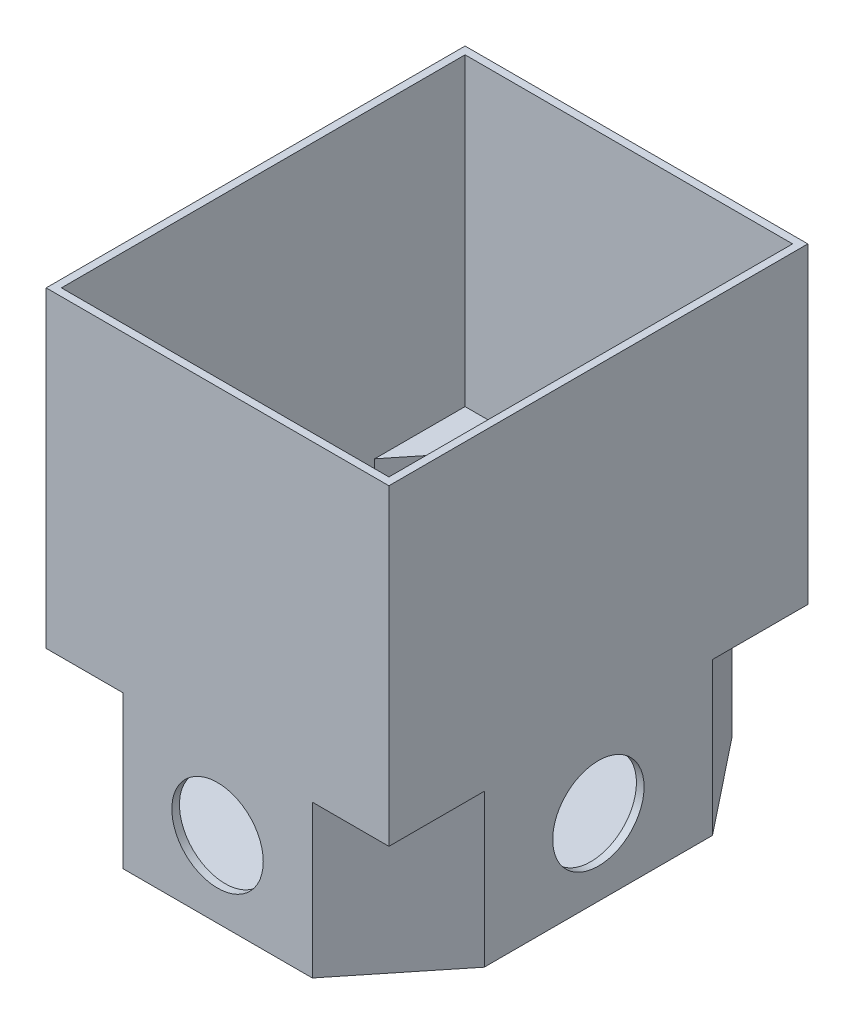
ISO-10303-21;
HEADER;
FILE_DESCRIPTION(('STEP AP214'),'2;1');
FILE_NAME('part.step','',(''),(''),'','','');
FILE_SCHEMA(('AUTOMOTIVE_DESIGN { 1 0 10303 214 1 1 1 1 }'));
ENDSEC;
DATA;
#1=APPLICATION_CONTEXT('core data for automotive mechanical design processes');
#2=APPLICATION_PROTOCOL_DEFINITION('international standard','automotive_design',2000,#1);
#3=PRODUCT_CONTEXT('',#1,'mechanical');
#4=PRODUCT('Part','Part','',(#3));
#5=PRODUCT_RELATED_PRODUCT_CATEGORY('part','',(#4));
#6=PRODUCT_DEFINITION_FORMATION('','',#4);
#7=PRODUCT_DEFINITION_CONTEXT('part definition',#1,'design');
#8=PRODUCT_DEFINITION('design','',#6,#7);
#9=PRODUCT_DEFINITION_SHAPE('','',#8);
#10=(LENGTH_UNIT() NAMED_UNIT(*) SI_UNIT(.MILLI.,.METRE.));
#11=(NAMED_UNIT(*) PLANE_ANGLE_UNIT() SI_UNIT($,.RADIAN.));
#12=(NAMED_UNIT(*) SI_UNIT($,.STERADIAN.) SOLID_ANGLE_UNIT());
#13=UNCERTAINTY_MEASURE_WITH_UNIT(LENGTH_MEASURE(1.E-05),#10,'distance_accuracy_value','');
#14=(GEOMETRIC_REPRESENTATION_CONTEXT(3) GLOBAL_UNCERTAINTY_ASSIGNED_CONTEXT((#13)) GLOBAL_UNIT_ASSIGNED_CONTEXT((#10,
#11,#12)) REPRESENTATION_CONTEXT('',''));
#15=CARTESIAN_POINT('',(0.,0.,0.));
#16=DIRECTION('',(0.,0.,1.));
#17=DIRECTION('',(1.,0.,0.));
#18=AXIS2_PLACEMENT_3D('',#15,#16,#17);
#19=CARTESIAN_POINT('',(0.,1.99999999999999,0.));
#20=DIRECTION('',(0.,-1.,0.));
#21=DIRECTION('',(0.,0.,-1.));
#22=AXIS2_PLACEMENT_3D('',#19,#20,#21);
#23=PLANE('',#22);
#24=DIRECTION('',(0.626402673453942,0.,-0.779499641237733));
#25=VECTOR('',#24,1.);
#26=CARTESIAN_POINT('',(9.36406161476732,1.99999999999999,49.6967114952726));
#27=LINE('',#26,#25);
#28=CARTESIAN_POINT('',(9.36406161476732,1.99999999999999,49.6967114952726));
#29=VERTEX_POINT('',#28);
#30=CARTESIAN_POINT('',(28.4415766183495,1.99999999999999,25.9565253000214));
#31=VERTEX_POINT('',#30);
#32=EDGE_CURVE('E290',#29,#31,#27,.T.);
#33=ORIENTED_EDGE('',*,*,#32,.F.);
#34=DIRECTION('',(1.,0.,0.));
#35=VECTOR('',#34,1.);
#36=CARTESIAN_POINT('',(-57.5584233816505,1.99999999999999,49.6967114952725));
#37=LINE('',#36,#35);
#38=CARTESIAN_POINT('',(28.4415766183495,1.99999999999999,49.6967114952729));
#39=VERTEX_POINT('',#38);
#40=EDGE_CURVE('E427',#29,#39,#37,.T.);
#41=ORIENTED_EDGE('',*,*,#40,.T.);
#42=DIRECTION('',(0.,0.,-1.));
#43=VECTOR('',#42,1.);
#44=CARTESIAN_POINT('',(28.4415766183495,1.99999999999999,49.6967114952728));
#45=LINE('',#44,#43);
#46=EDGE_CURVE('E422',#39,#31,#45,.T.);
#47=ORIENTED_EDGE('',*,*,#46,.T.);
#48=EDGE_LOOP('',(#33,#41,#47));
#49=FACE_BOUND('',#48,.T.);
#50=ADVANCED_FACE('F118',(#49),#23,.F.);
#51=DIRECTION('',(-0.621870274614548,0.,-0.78312027272369));
#52=VECTOR('',#51,1.);
#53=CARTESIAN_POINT('',(28.4415766183495,1.99999999999999,-32.5696154981396));
#54=LINE('',#53,#52);
#55=CARTESIAN_POINT('',(28.4415766183495,1.99999999999999,-32.5696154981396));
#56=VERTEX_POINT('',#55);
#57=CARTESIAN_POINT('',(9.59483459890732,1.99999999999999,-56.3032885047273));
#58=VERTEX_POINT('',#57);
#59=EDGE_CURVE('E331',#56,#58,#54,.T.);
#60=ORIENTED_EDGE('',*,*,#59,.F.);
#61=CARTESIAN_POINT('',(28.4415766183495,1.99999999999999,-56.3032885047272));
#62=VERTEX_POINT('',#61);
#63=EDGE_CURVE('E483',#56,#62,#45,.T.);
#64=ORIENTED_EDGE('',*,*,#63,.T.);
#65=DIRECTION('',(-1.,0.,0.));
#66=VECTOR('',#65,1.);
#67=CARTESIAN_POINT('',(28.4415766183495,1.99999999999999,-56.3032885047272));
#68=LINE('',#67,#66);
#69=EDGE_CURVE('E495',#62,#58,#68,.T.);
#70=ORIENTED_EDGE('',*,*,#69,.T.);
#71=EDGE_LOOP('',(#60,#64,#70));
#72=FACE_BOUND('',#71,.T.);
#73=ADVANCED_FACE('F589',(#72),#23,.F.);
#74=DIRECTION('',(-0.626402673453942,0.,0.779499641237733));
#75=VECTOR('',#74,1.);
#76=CARTESIAN_POINT('',(-38.4809083780684,1.99999999999999,-56.3032885047273));
#77=LINE('',#76,#75);
#78=CARTESIAN_POINT('',(-38.4809083780684,1.99999999999999,-56.3032885047273));
#79=VERTEX_POINT('',#78);
#80=CARTESIAN_POINT('',(-57.5584233816505,1.99999999999999,-32.5631023094761));
#81=VERTEX_POINT('',#80);
#82=EDGE_CURVE('E311',#79,#81,#77,.T.);
#83=ORIENTED_EDGE('',*,*,#82,.F.);
#84=CARTESIAN_POINT('',(-57.5584233816505,1.99999999999999,-56.3032885047276));
#85=VERTEX_POINT('',#84);
#86=EDGE_CURVE('E403',#79,#85,#68,.T.);
#87=ORIENTED_EDGE('',*,*,#86,.T.);
#88=DIRECTION('',(0.,0.,1.));
#89=VECTOR('',#88,1.);
#90=CARTESIAN_POINT('',(-57.5584233816505,1.99999999999999,-56.3032885047276));
#91=LINE('',#90,#89);
#92=EDGE_CURVE('E430',#85,#81,#91,.T.);
#93=ORIENTED_EDGE('',*,*,#92,.T.);
#94=EDGE_LOOP('',(#83,#87,#93));
#95=FACE_BOUND('',#94,.T.);
#96=ADVANCED_FACE('F595',(#95),#23,.F.);
#97=DIRECTION('',(0.626402673453942,0.,0.779499641237733));
#98=VECTOR('',#97,1.);
#99=CARTESIAN_POINT('',(-57.5584233816505,1.99999999999999,25.9565253000214));
#100=LINE('',#99,#98);
#101=CARTESIAN_POINT('',(-57.5584233816505,1.99999999999999,25.9565253000214));
#102=VERTEX_POINT('',#101);
#103=CARTESIAN_POINT('',(-38.4809083780684,1.99999999999999,49.6967114952726));
#104=VERTEX_POINT('',#103);
#105=EDGE_CURVE('E309',#102,#104,#100,.T.);
#106=ORIENTED_EDGE('',*,*,#105,.F.);
#107=CARTESIAN_POINT('',(-57.5584233816505,1.99999999999999,49.6967114952725));
#108=VERTEX_POINT('',#107);
#109=EDGE_CURVE('E379',#102,#108,#91,.T.);
#110=ORIENTED_EDGE('',*,*,#109,.T.);
#111=EDGE_CURVE('E415',#108,#104,#37,.T.);
#112=ORIENTED_EDGE('',*,*,#111,.T.);
#113=EDGE_LOOP('',(#106,#110,#112));
#114=FACE_BOUND('',#113,.T.);
#115=ADVANCED_FACE('F591',(#114),#23,.F.);
#116=CARTESIAN_POINT('',(0.,0.,0.));
#117=DIRECTION('',(0.,1.,0.));
#118=DIRECTION('',(0.,0.,1.));
#119=AXIS2_PLACEMENT_3D('',#116,#117,#118);
#120=PLANE('',#119);
#121=DIRECTION('',(0.621870274614548,0.,0.78312027272369));
#122=VECTOR('',#121,1.);
#123=CARTESIAN_POINT('',(10.5605348586396,0.,-58.3032885047274));
#124=LINE('',#123,#122);
#125=CARTESIAN_POINT('',(10.5605348586396,0.,-58.3032885047274));
#126=VERTEX_POINT('',#125);
#127=CARTESIAN_POINT('',(30.4415766183495,0.,-33.267123438717));
#128=VERTEX_POINT('',#127);
#129=EDGE_CURVE('E338',#126,#128,#124,.T.);
#130=ORIENTED_EDGE('',*,*,#129,.F.);
#131=DIRECTION('',(-1.,0.,0.));
#132=VECTOR('',#131,1.);
#133=CARTESIAN_POINT('',(-59.5584233816505,0.,-58.3032885047274));
#134=LINE('',#133,#132);
#135=CARTESIAN_POINT('',(30.4415766183495,0.,-58.3032885047274));
#136=VERTEX_POINT('',#135);
#137=EDGE_CURVE('E514',#136,#126,#134,.T.);
#138=ORIENTED_EDGE('',*,*,#137,.F.);
#139=DIRECTION('',(0.,0.,-1.));
#140=VECTOR('',#139,1.);
#141=CARTESIAN_POINT('',(30.4415766183495,0.,-58.3032885047274));
#142=LINE('',#141,#140);
#143=EDGE_CURVE('E527',#128,#136,#142,.T.);
#144=ORIENTED_EDGE('',*,*,#143,.F.);
#145=EDGE_LOOP('',(#130,#138,#144));
#146=FACE_BOUND('',#145,.T.);
#147=ADVANCED_FACE('F566',(#146),#120,.F.);
#148=DIRECTION('',(0.626402673453942,0.,-0.779499641237733));
#149=VECTOR('',#148,1.);
#150=CARTESIAN_POINT('',(-59.5584233816505,0.,-33.2671234387169));
#151=LINE('',#150,#149);
#152=CARTESIAN_POINT('',(-59.5584233816505,0.,-33.2671234387169));
#153=VERTEX_POINT('',#152);
#154=CARTESIAN_POINT('',(-39.4394651413604,0.,-58.3032885047274));
#155=VERTEX_POINT('',#154);
#156=EDGE_CURVE('E370',#153,#155,#151,.T.);
#157=ORIENTED_EDGE('',*,*,#156,.F.);
#158=DIRECTION('',(0.,0.,1.));
#159=VECTOR('',#158,1.);
#160=CARTESIAN_POINT('',(-59.5584233816505,0.,-58.3032885047274));
#161=LINE('',#160,#159);
#162=CARTESIAN_POINT('',(-59.5584233816505,0.,-58.3032885047274));
#163=VERTEX_POINT('',#162);
#164=EDGE_CURVE('E521',#163,#153,#161,.T.);
#165=ORIENTED_EDGE('',*,*,#164,.F.);
#166=EDGE_CURVE('E531',#155,#163,#134,.T.);
#167=ORIENTED_EDGE('',*,*,#166,.F.);
#168=EDGE_LOOP('',(#157,#165,#167));
#169=FACE_BOUND('',#168,.T.);
#170=ADVANCED_FACE('F580',(#169),#120,.F.);
#171=DIRECTION('',(-0.626402673453941,0.,-0.779499641237733));
#172=VECTOR('',#171,1.);
#173=CARTESIAN_POINT('',(-39.4394651413604,0.,51.6967114952727));
#174=LINE('',#173,#172);
#175=CARTESIAN_POINT('',(-39.4394651413604,0.,51.6967114952727));
#176=VERTEX_POINT('',#175);
#177=CARTESIAN_POINT('',(-59.5584233816505,0.,26.6605464292621));
#178=VERTEX_POINT('',#177);
#179=EDGE_CURVE('E143',#176,#178,#174,.T.);
#180=ORIENTED_EDGE('',*,*,#179,.F.);
#181=DIRECTION('',(1.,0.,0.));
#182=VECTOR('',#181,1.);
#183=CARTESIAN_POINT('',(-59.5584233816505,0.,51.6967114952727));
#184=LINE('',#183,#182);
#185=CARTESIAN_POINT('',(-59.5584233816505,0.,51.6967114952727));
#186=VERTEX_POINT('',#185);
#187=EDGE_CURVE('E525',#186,#176,#184,.T.);
#188=ORIENTED_EDGE('',*,*,#187,.F.);
#189=EDGE_CURVE('E414',#178,#186,#161,.T.);
#190=ORIENTED_EDGE('',*,*,#189,.F.);
#191=EDGE_LOOP('',(#180,#188,#190));
#192=FACE_BOUND('',#191,.T.);
#193=ADVANCED_FACE('F578',(#192),#120,.F.);
#194=DIRECTION('',(-0.626402673453942,0.,0.779499641237733));
#195=VECTOR('',#194,1.);
#196=CARTESIAN_POINT('',(30.4415766183495,0.,26.6605464292622));
#197=LINE('',#196,#195);
#198=CARTESIAN_POINT('',(30.4415766183495,0.,26.6605464292622));
#199=VERTEX_POINT('',#198);
#200=CARTESIAN_POINT('',(10.3226183780593,0.,51.6967114952727));
#201=VERTEX_POINT('',#200);
#202=EDGE_CURVE('E353',#199,#201,#197,.T.);
#203=ORIENTED_EDGE('',*,*,#202,.F.);
#204=CARTESIAN_POINT('',(30.4415766183495,0.,51.6967114952727));
#205=VERTEX_POINT('',#204);
#206=EDGE_CURVE('E528',#205,#199,#142,.T.);
#207=ORIENTED_EDGE('',*,*,#206,.F.);
#208=EDGE_CURVE('E524',#201,#205,#184,.T.);
#209=ORIENTED_EDGE('',*,*,#208,.F.);
#210=EDGE_LOOP('',(#203,#207,#209));
#211=FACE_BOUND('',#210,.T.);
#212=ADVANCED_FACE('F547',(#211),#120,.F.);
#213=CARTESIAN_POINT('',(0.,82.,0.));
#214=DIRECTION('',(0.,1.,0.));
#215=DIRECTION('',(0.,0.,1.));
#216=AXIS2_PLACEMENT_3D('',#213,#214,#215);
#217=PLANE('',#216);
#218=DIRECTION('',(0.,0.,1.));
#219=VECTOR('',#218,1.);
#220=CARTESIAN_POINT('',(-59.5584233816505,82.,-58.3032885047274));
#221=LINE('',#220,#219);
#222=CARTESIAN_POINT('',(-59.5584233816505,82.,-58.3032885047274));
#223=VERTEX_POINT('',#222);
#224=CARTESIAN_POINT('',(-59.5584233816505,82.,51.6967114952727));
#225=VERTEX_POINT('',#224);
#226=EDGE_CURVE('E510',#223,#225,#221,.T.);
#227=ORIENTED_EDGE('',*,*,#226,.T.);
#228=DIRECTION('',(1.,0.,0.));
#229=VECTOR('',#228,1.);
#230=CARTESIAN_POINT('',(-59.5584233816505,82.,51.6967114952727));
#231=LINE('',#230,#229);
#232=CARTESIAN_POINT('',(30.4415766183495,82.,51.6967114952727));
#233=VERTEX_POINT('',#232);
#234=EDGE_CURVE('E513',#225,#233,#231,.T.);
#235=ORIENTED_EDGE('',*,*,#234,.T.);
#236=DIRECTION('',(0.,0.,-1.));
#237=VECTOR('',#236,1.);
#238=CARTESIAN_POINT('',(30.4415766183495,82.,-58.3032885047274));
#239=LINE('',#238,#237);
#240=CARTESIAN_POINT('',(30.4415766183495,82.,-58.3032885047274));
#241=VERTEX_POINT('',#240);
#242=EDGE_CURVE('E516',#233,#241,#239,.T.);
#243=ORIENTED_EDGE('',*,*,#242,.T.);
#244=DIRECTION('',(-1.,0.,0.));
#245=VECTOR('',#244,1.);
#246=CARTESIAN_POINT('',(-59.5584233816505,82.,-58.3032885047274));
#247=LINE('',#246,#245);
#248=EDGE_CURVE('E518',#241,#223,#247,.T.);
#249=ORIENTED_EDGE('',*,*,#248,.T.);
#250=EDGE_LOOP('',(#227,#235,#243,#249));
#251=FACE_BOUND('',#250,.T.);
#252=DIRECTION('',(1.,0.,0.));
#253=VECTOR('',#252,1.);
#254=CARTESIAN_POINT('',(-57.5584233816505,82.,49.6967114952725));
#255=LINE('',#254,#253);
#256=CARTESIAN_POINT('',(-57.5584233816505,82.,49.6967114952725));
#257=VERTEX_POINT('',#256);
#258=CARTESIAN_POINT('',(28.4415766183495,82.,49.6967114952729));
#259=VERTEX_POINT('',#258);
#260=EDGE_CURVE('E411',#257,#259,#255,.T.);
#261=ORIENTED_EDGE('',*,*,#260,.F.);
#262=DIRECTION('',(0.,0.,1.));
#263=VECTOR('',#262,1.);
#264=CARTESIAN_POINT('',(-57.5584233816505,82.,-56.3032885047276));
#265=LINE('',#264,#263);
#266=CARTESIAN_POINT('',(-57.5584233816505,82.,-56.3032885047276));
#267=VERTEX_POINT('',#266);
#268=EDGE_CURVE('E404',#267,#257,#265,.T.);
#269=ORIENTED_EDGE('',*,*,#268,.F.);
#270=DIRECTION('',(-1.,0.,0.));
#271=VECTOR('',#270,1.);
#272=CARTESIAN_POINT('',(28.4415766183495,82.,-56.3032885047272));
#273=LINE('',#272,#271);
#274=CARTESIAN_POINT('',(28.4415766183495,82.,-56.3032885047272));
#275=VERTEX_POINT('',#274);
#276=EDGE_CURVE('E494',#275,#267,#273,.T.);
#277=ORIENTED_EDGE('',*,*,#276,.F.);
#278=DIRECTION('',(0.,0.,-1.));
#279=VECTOR('',#278,1.);
#280=CARTESIAN_POINT('',(28.4415766183495,82.,49.6967114952728));
#281=LINE('',#280,#279);
#282=EDGE_CURVE('E421',#259,#275,#281,.T.);
#283=ORIENTED_EDGE('',*,*,#282,.F.);
#284=EDGE_LOOP('',(#261,#269,#277,#283));
#285=FACE_BOUND('',#284,.T.);
#286=ADVANCED_FACE('F573',(#251,#285),#217,.T.);
#287=CARTESIAN_POINT('',(-59.5584233816505,82.,-58.3032885047274));
#288=DIRECTION('',(1.,0.,0.));
#289=DIRECTION('',(0.,0.,-1.));
#290=AXIS2_PLACEMENT_3D('',#287,#288,#289);
#291=PLANE('',#290);
#292=CARTESIAN_POINT('',(-59.5584233816505,-20.,-3.30328850472733));
#293=DIRECTION('',(1.,0.,0.));
#294=DIRECTION('',(0.,0.,-1.));
#295=AXIS2_PLACEMENT_3D('',#292,#293,#294);
#296=CIRCLE('',#295,12.);
#297=CARTESIAN_POINT('',(-59.5584233816505,-20.,-15.3032885047273));
#298=VERTEX_POINT('',#297);
#299=EDGE_CURVE('E314',#298,#298,#296,.T.);
#300=ORIENTED_EDGE('',*,*,#299,.T.);
#301=EDGE_LOOP('',(#300));
#302=FACE_BOUND('',#301,.T.);
#303=ORIENTED_EDGE('',*,*,#164,.T.);
#304=DIRECTION('',(0.,1.,0.));
#305=VECTOR('',#304,1.);
#306=CARTESIAN_POINT('',(-59.5584233816505,-40.,-33.2671234387169));
#307=LINE('',#306,#305);
#308=CARTESIAN_POINT('',(-59.5584233816505,-40.,-33.2671234387169));
#309=VERTEX_POINT('',#308);
#310=EDGE_CURVE('E389',#309,#153,#307,.T.);
#311=ORIENTED_EDGE('',*,*,#310,.F.);
#312=DIRECTION('',(0.,0.,-1.));
#313=VECTOR('',#312,1.);
#314=CARTESIAN_POINT('',(-59.5584233816505,-40.,26.6605464292622));
#315=LINE('',#314,#313);
#316=CARTESIAN_POINT('',(-59.5584233816505,-40.,26.6605464292622));
#317=VERTEX_POINT('',#316);
#318=EDGE_CURVE('E359',#317,#309,#315,.T.);
#319=ORIENTED_EDGE('',*,*,#318,.F.);
#320=DIRECTION('',(0.,1.,0.));
#321=VECTOR('',#320,1.);
#322=CARTESIAN_POINT('',(-59.5584233816505,-40.,26.6605464292622));
#323=LINE('',#322,#321);
#324=EDGE_CURVE('E386',#317,#178,#323,.T.);
#325=ORIENTED_EDGE('',*,*,#324,.T.);
#326=ORIENTED_EDGE('',*,*,#189,.T.);
#327=DIRECTION('',(0.,-1.,0.));
#328=VECTOR('',#327,1.);
#329=CARTESIAN_POINT('',(-59.5584233816505,82.,51.6967114952727));
#330=LINE('',#329,#328);
#331=EDGE_CURVE('E14',#225,#186,#330,.T.);
#332=ORIENTED_EDGE('',*,*,#331,.F.);
#333=ORIENTED_EDGE('',*,*,#226,.F.);
#334=DIRECTION('',(0.,-1.,0.));
#335=VECTOR('',#334,1.);
#336=CARTESIAN_POINT('',(-59.5584233816505,82.,-58.3032885047274));
#337=LINE('',#336,#335);
#338=EDGE_CURVE('E520',#223,#163,#337,.T.);
#339=ORIENTED_EDGE('',*,*,#338,.T.);
#340=EDGE_LOOP('',(#303,#311,#319,#325,#326,#332,#333,#339));
#341=FACE_BOUND('',#340,.T.);
#342=ADVANCED_FACE('F120',(#302,#341),#291,.F.);
#343=CARTESIAN_POINT('',(-59.5584233816505,82.,51.6967114952727));
#344=DIRECTION('',(0.,0.,-1.));
#345=DIRECTION('',(-1.,0.,0.));
#346=AXIS2_PLACEMENT_3D('',#343,#344,#345);
#347=PLANE('',#346);
#348=CARTESIAN_POINT('',(-14.5584233816505,-20.,51.6967114952727));
#349=DIRECTION('',(0.,0.,1.));
#350=DIRECTION('',(1.,0.,0.));
#351=AXIS2_PLACEMENT_3D('',#348,#349,#350);
#352=CIRCLE('',#351,12.0032820116129);
#353=CARTESIAN_POINT('',(-2.55514137003762,-20.,51.6967114952726));
#354=VERTEX_POINT('',#353);
#355=EDGE_CURVE('E459',#354,#354,#352,.T.);
#356=ORIENTED_EDGE('',*,*,#355,.F.);
#357=EDGE_LOOP('',(#356));
#358=FACE_BOUND('',#357,.T.);
#359=ORIENTED_EDGE('',*,*,#187,.T.);
#360=DIRECTION('',(0.,1.,0.));
#361=VECTOR('',#360,1.);
#362=CARTESIAN_POINT('',(-39.4394651413604,-40.,51.6967114952727));
#363=LINE('',#362,#361);
#364=CARTESIAN_POINT('',(-39.4394651413604,-40.,51.6967114952727));
#365=VERTEX_POINT('',#364);
#366=EDGE_CURVE('E383',#365,#176,#363,.T.);
#367=ORIENTED_EDGE('',*,*,#366,.F.);
#368=DIRECTION('',(-1.,0.,0.));
#369=VECTOR('',#368,1.);
#370=CARTESIAN_POINT('',(10.3226183780593,-40.,51.6967114952727));
#371=LINE('',#370,#369);
#372=CARTESIAN_POINT('',(10.3226183780593,-40.,51.6967114952727));
#373=VERTEX_POINT('',#372);
#374=EDGE_CURVE('E363',#373,#365,#371,.T.);
#375=ORIENTED_EDGE('',*,*,#374,.F.);
#376=DIRECTION('',(0.,1.,0.));
#377=VECTOR('',#376,1.);
#378=CARTESIAN_POINT('',(10.3226183780593,-40.,51.6967114952727));
#379=LINE('',#378,#377);
#380=EDGE_CURVE('E380',#373,#201,#379,.T.);
#381=ORIENTED_EDGE('',*,*,#380,.T.);
#382=ORIENTED_EDGE('',*,*,#208,.T.);
#383=DIRECTION('',(0.,-1.,0.));
#384=VECTOR('',#383,1.);
#385=CARTESIAN_POINT('',(30.4415766183495,82.,51.6967114952727));
#386=LINE('',#385,#384);
#387=EDGE_CURVE('E127',#233,#205,#386,.T.);
#388=ORIENTED_EDGE('',*,*,#387,.F.);
#389=ORIENTED_EDGE('',*,*,#234,.F.);
#390=ORIENTED_EDGE('',*,*,#331,.T.);
#391=EDGE_LOOP('',(#359,#367,#375,#381,#382,#388,#389,#390));
#392=FACE_BOUND('',#391,.T.);
#393=ADVANCED_FACE('F552',(#358,#392),#347,.F.);
#394=CARTESIAN_POINT('',(30.4415766183495,82.,-58.3032885047274));
#395=DIRECTION('',(-1.,0.,0.));
#396=DIRECTION('',(0.,0.,1.));
#397=AXIS2_PLACEMENT_3D('',#394,#395,#396);
#398=PLANE('',#397);
#399=CARTESIAN_POINT('',(30.4415766183495,-20.,-3.30328850472734));
#400=DIRECTION('',(1.,0.,0.));
#401=DIRECTION('',(0.,0.,-1.));
#402=AXIS2_PLACEMENT_3D('',#399,#400,#401);
#403=CIRCLE('',#402,12.);
#404=CARTESIAN_POINT('',(30.4415766183495,-20.,-15.3032885047273));
#405=VERTEX_POINT('',#404);
#406=EDGE_CURVE('E444',#405,#405,#403,.T.);
#407=ORIENTED_EDGE('',*,*,#406,.F.);
#408=EDGE_LOOP('',(#407));
#409=FACE_BOUND('',#408,.T.);
#410=ORIENTED_EDGE('',*,*,#206,.T.);
#411=DIRECTION('',(0.,1.,0.));
#412=VECTOR('',#411,1.);
#413=CARTESIAN_POINT('',(30.4415766183495,-40.,26.6605464292622));
#414=LINE('',#413,#412);
#415=CARTESIAN_POINT('',(30.4415766183495,-40.,26.6605464292622));
#416=VERTEX_POINT('',#415);
#417=EDGE_CURVE('E376',#416,#199,#414,.T.);
#418=ORIENTED_EDGE('',*,*,#417,.F.);
#419=DIRECTION('',(0.,0.,-1.));
#420=VECTOR('',#419,1.);
#421=CARTESIAN_POINT('',(30.4415766183495,-40.,26.6605464292622));
#422=LINE('',#421,#420);
#423=CARTESIAN_POINT('',(30.4415766183495,-40.,-33.2671234387169));
#424=VERTEX_POINT('',#423);
#425=EDGE_CURVE('E349',#416,#424,#422,.T.);
#426=ORIENTED_EDGE('',*,*,#425,.T.);
#427=DIRECTION('',(0.,1.,0.));
#428=VECTOR('',#427,1.);
#429=CARTESIAN_POINT('',(30.4415766183495,-40.,-33.2671234387169));
#430=LINE('',#429,#428);
#431=EDGE_CURVE('E367',#424,#128,#430,.T.);
#432=ORIENTED_EDGE('',*,*,#431,.T.);
#433=ORIENTED_EDGE('',*,*,#143,.T.);
#434=DIRECTION('',(0.,-1.,0.));
#435=VECTOR('',#434,1.);
#436=CARTESIAN_POINT('',(30.4415766183495,82.,-58.3032885047274));
#437=LINE('',#436,#435);
#438=EDGE_CURVE('E536',#241,#136,#437,.T.);
#439=ORIENTED_EDGE('',*,*,#438,.F.);
#440=ORIENTED_EDGE('',*,*,#242,.F.);
#441=ORIENTED_EDGE('',*,*,#387,.T.);
#442=EDGE_LOOP('',(#410,#418,#426,#432,#433,#439,#440,#441));
#443=FACE_BOUND('',#442,.T.);
#444=ADVANCED_FACE('F543',(#409,#443),#398,.F.);
#445=CARTESIAN_POINT('',(-59.5584233816505,82.,-58.3032885047274));
#446=DIRECTION('',(0.,0.,1.));
#447=DIRECTION('',(1.,0.,0.));
#448=AXIS2_PLACEMENT_3D('',#445,#446,#447);
#449=PLANE('',#448);
#450=CARTESIAN_POINT('',(-14.5584233816505,-20.,-58.3032885047274));
#451=DIRECTION('',(0.,0.,1.));
#452=DIRECTION('',(1.,0.,0.));
#453=AXIS2_PLACEMENT_3D('',#450,#451,#452);
#454=CIRCLE('',#453,12.0032820116129);
#455=CARTESIAN_POINT('',(-2.55514137003762,-20.,-58.3032885047274));
#456=VERTEX_POINT('',#455);
#457=EDGE_CURVE('E449',#456,#456,#454,.T.);
#458=ORIENTED_EDGE('',*,*,#457,.T.);
#459=EDGE_LOOP('',(#458));
#460=FACE_BOUND('',#459,.T.);
#461=ORIENTED_EDGE('',*,*,#137,.T.);
#462=DIRECTION('',(0.,1.,0.));
#463=VECTOR('',#462,1.);
#464=CARTESIAN_POINT('',(10.5605348586396,-40.,-58.3032885047274));
#465=LINE('',#464,#463);
#466=CARTESIAN_POINT('',(10.5605348586396,-40.,-58.3032885047274));
#467=VERTEX_POINT('',#466);
#468=EDGE_CURVE('E395',#467,#126,#465,.T.);
#469=ORIENTED_EDGE('',*,*,#468,.F.);
#470=DIRECTION('',(1.,0.,0.));
#471=VECTOR('',#470,1.);
#472=CARTESIAN_POINT('',(-39.4394651413604,-40.,-58.3032885047274));
#473=LINE('',#472,#471);
#474=CARTESIAN_POINT('',(-39.4394651413604,-40.,-58.3032885047274));
#475=VERTEX_POINT('',#474);
#476=EDGE_CURVE('E355',#475,#467,#473,.T.);
#477=ORIENTED_EDGE('',*,*,#476,.F.);
#478=DIRECTION('',(0.,1.,0.));
#479=VECTOR('',#478,1.);
#480=CARTESIAN_POINT('',(-39.4394651413604,-40.,-58.3032885047274));
#481=LINE('',#480,#479);
#482=EDGE_CURVE('E392',#475,#155,#481,.T.);
#483=ORIENTED_EDGE('',*,*,#482,.T.);
#484=ORIENTED_EDGE('',*,*,#166,.T.);
#485=ORIENTED_EDGE('',*,*,#338,.F.);
#486=ORIENTED_EDGE('',*,*,#248,.F.);
#487=ORIENTED_EDGE('',*,*,#438,.T.);
#488=EDGE_LOOP('',(#461,#469,#477,#483,#484,#485,#486,#487));
#489=FACE_BOUND('',#488,.T.);
#490=ADVANCED_FACE('F473',(#460,#489),#449,.F.);
#491=CARTESIAN_POINT('',(-57.5584233816505,82.,-56.3032885047276));
#492=DIRECTION('',(1.,0.,0.));
#493=DIRECTION('',(0.,0.,-1.));
#494=AXIS2_PLACEMENT_3D('',#491,#492,#493);
#495=PLANE('',#494);
#496=CARTESIAN_POINT('',(-57.5584233816505,-20.,-3.30328850472733));
#497=DIRECTION('',(1.,0.,0.));
#498=DIRECTION('',(0.,0.,-1.));
#499=AXIS2_PLACEMENT_3D('',#496,#497,#498);
#500=CIRCLE('',#499,12.);
#501=CARTESIAN_POINT('',(-57.5584233816505,-20.,-15.3032885047273));
#502=VERTEX_POINT('',#501);
#503=EDGE_CURVE('E443',#502,#502,#500,.T.);
#504=ORIENTED_EDGE('',*,*,#503,.F.);
#505=EDGE_LOOP('',(#504));
#506=FACE_BOUND('',#505,.T.);
#507=ORIENTED_EDGE('',*,*,#92,.F.);
#508=DIRECTION('',(0.,-1.,0.));
#509=VECTOR('',#508,1.);
#510=CARTESIAN_POINT('',(-57.5584233816505,82.,-56.3032885047276));
#511=LINE('',#510,#509);
#512=EDGE_CURVE('E408',#267,#85,#511,.T.);
#513=ORIENTED_EDGE('',*,*,#512,.F.);
#514=ORIENTED_EDGE('',*,*,#268,.T.);
#515=DIRECTION('',(0.,-1.,0.));
#516=VECTOR('',#515,1.);
#517=CARTESIAN_POINT('',(-57.5584233816505,82.,49.6967114952725));
#518=LINE('',#517,#516);
#519=EDGE_CURVE('E400',#257,#108,#518,.T.);
#520=ORIENTED_EDGE('',*,*,#519,.T.);
#521=ORIENTED_EDGE('',*,*,#109,.F.);
#522=DIRECTION('',(0.,1.,0.));
#523=VECTOR('',#522,1.);
#524=CARTESIAN_POINT('',(-57.5584233816505,-38.,25.9565253000214));
#525=LINE('',#524,#523);
#526=CARTESIAN_POINT('',(-57.5584233816505,-38.,25.9565253000214));
#527=VERTEX_POINT('',#526);
#528=EDGE_CURVE('E135',#527,#102,#525,.T.);
#529=ORIENTED_EDGE('',*,*,#528,.F.);
#530=DIRECTION('',(0.,0.,1.));
#531=VECTOR('',#530,1.);
#532=CARTESIAN_POINT('',(-57.5584233816505,-38.,-32.5631023094761));
#533=LINE('',#532,#531);
#534=CARTESIAN_POINT('',(-57.5584233816505,-38.,-32.5631023094761));
#535=VERTEX_POINT('',#534);
#536=EDGE_CURVE('E324',#535,#527,#533,.T.);
#537=ORIENTED_EDGE('',*,*,#536,.F.);
#538=DIRECTION('',(0.,1.,0.));
#539=VECTOR('',#538,1.);
#540=CARTESIAN_POINT('',(-57.5584233816505,-38.,-32.5631023094761));
#541=LINE('',#540,#539);
#542=EDGE_CURVE('E342',#535,#81,#541,.T.);
#543=ORIENTED_EDGE('',*,*,#542,.T.);
#544=EDGE_LOOP('',(#507,#513,#514,#520,#521,#529,#537,#543));
#545=FACE_BOUND('',#544,.T.);
#546=ADVANCED_FACE('F606',(#506,#545),#495,.T.);
#547=CARTESIAN_POINT('',(28.4415766183495,82.,-56.3032885047272));
#548=DIRECTION('',(0.,0.,1.));
#549=DIRECTION('',(1.,0.,0.));
#550=AXIS2_PLACEMENT_3D('',#547,#548,#549);
#551=PLANE('',#550);
#552=CARTESIAN_POINT('',(-14.5584233816505,-20.,-56.3032885047274));
#553=DIRECTION('',(0.,0.,1.));
#554=DIRECTION('',(1.,0.,0.));
#555=AXIS2_PLACEMENT_3D('',#552,#553,#554);
#556=CIRCLE('',#555,12.0032820116129);
#557=CARTESIAN_POINT('',(-2.55514137003762,-20.,-56.3032885047273));
#558=VERTEX_POINT('',#557);
#559=EDGE_CURVE('E454',#558,#558,#556,.T.);
#560=ORIENTED_EDGE('',*,*,#559,.F.);
#561=EDGE_LOOP('',(#560));
#562=FACE_BOUND('',#561,.T.);
#563=ORIENTED_EDGE('',*,*,#69,.F.);
#564=DIRECTION('',(0.,-1.,0.));
#565=VECTOR('',#564,1.);
#566=CARTESIAN_POINT('',(28.4415766183495,82.,-56.3032885047272));
#567=LINE('',#566,#565);
#568=EDGE_CURVE('E490',#275,#62,#567,.T.);
#569=ORIENTED_EDGE('',*,*,#568,.F.);
#570=ORIENTED_EDGE('',*,*,#276,.T.);
#571=ORIENTED_EDGE('',*,*,#512,.T.);
#572=ORIENTED_EDGE('',*,*,#86,.F.);
#573=DIRECTION('',(0.,1.,0.));
#574=VECTOR('',#573,1.);
#575=CARTESIAN_POINT('',(-38.4809083780684,-38.,-56.3032885047273));
#576=LINE('',#575,#574);
#577=CARTESIAN_POINT('',(-38.4809083780684,-38.,-56.3032885047273));
#578=VERTEX_POINT('',#577);
#579=EDGE_CURVE('E344',#578,#79,#576,.T.);
#580=ORIENTED_EDGE('',*,*,#579,.F.);
#581=DIRECTION('',(-1.,0.,0.));
#582=VECTOR('',#581,1.);
#583=CARTESIAN_POINT('',(9.59483459890732,-38.,-56.3032885047273));
#584=LINE('',#583,#582);
#585=CARTESIAN_POINT('',(9.59483459890732,-38.,-56.3032885047273));
#586=VERTEX_POINT('',#585);
#587=EDGE_CURVE('E318',#586,#578,#584,.T.);
#588=ORIENTED_EDGE('',*,*,#587,.F.);
#589=DIRECTION('',(0.,1.,0.));
#590=VECTOR('',#589,1.);
#591=CARTESIAN_POINT('',(9.59483459890732,-38.,-56.3032885047273));
#592=LINE('',#591,#590);
#593=EDGE_CURVE('E346',#586,#58,#592,.T.);
#594=ORIENTED_EDGE('',*,*,#593,.T.);
#595=EDGE_LOOP('',(#563,#569,#570,#571,#572,#580,#588,#594));
#596=FACE_BOUND('',#595,.T.);
#597=ADVANCED_FACE('F613',(#562,#596),#551,.T.);
#598=CARTESIAN_POINT('',(28.4415766183495,82.,49.6967114952728));
#599=DIRECTION('',(-1.,0.,0.));
#600=DIRECTION('',(0.,0.,1.));
#601=AXIS2_PLACEMENT_3D('',#598,#599,#600);
#602=PLANE('',#601);
#603=CARTESIAN_POINT('',(28.4415766183495,-20.,-3.30328850472734));
#604=DIRECTION('',(-1.,0.,0.));
#605=DIRECTION('',(0.,0.,1.));
#606=AXIS2_PLACEMENT_3D('',#603,#604,#605);
#607=CIRCLE('',#606,12.);
#608=CARTESIAN_POINT('',(28.4415766183495,-20.,8.69671149527267));
#609=VERTEX_POINT('',#608);
#610=EDGE_CURVE('E441',#609,#609,#607,.T.);
#611=ORIENTED_EDGE('',*,*,#610,.F.);
#612=EDGE_LOOP('',(#611));
#613=FACE_BOUND('',#612,.T.);
#614=ORIENTED_EDGE('',*,*,#46,.F.);
#615=DIRECTION('',(0.,-1.,0.));
#616=VECTOR('',#615,1.);
#617=CARTESIAN_POINT('',(28.4415766183495,82.,49.6967114952728));
#618=LINE('',#617,#616);
#619=EDGE_CURVE('E418',#259,#39,#618,.T.);
#620=ORIENTED_EDGE('',*,*,#619,.F.);
#621=ORIENTED_EDGE('',*,*,#282,.T.);
#622=ORIENTED_EDGE('',*,*,#568,.T.);
#623=ORIENTED_EDGE('',*,*,#63,.F.);
#624=DIRECTION('',(0.,1.,0.));
#625=VECTOR('',#624,1.);
#626=CARTESIAN_POINT('',(28.4415766183495,-38.,-32.5696154981396));
#627=LINE('',#626,#625);
#628=CARTESIAN_POINT('',(28.4415766183495,-38.,-32.5696154981396));
#629=VERTEX_POINT('',#628);
#630=EDGE_CURVE('E294',#629,#56,#627,.T.);
#631=ORIENTED_EDGE('',*,*,#630,.F.);
#632=DIRECTION('',(0.,0.,-1.));
#633=VECTOR('',#632,1.);
#634=CARTESIAN_POINT('',(28.4415766183495,-38.,25.9565253000214));
#635=LINE('',#634,#633);
#636=CARTESIAN_POINT('',(28.4415766183495,-38.,25.9565253000214));
#637=VERTEX_POINT('',#636);
#638=EDGE_CURVE('E298',#637,#629,#635,.T.);
#639=ORIENTED_EDGE('',*,*,#638,.F.);
#640=DIRECTION('',(0.,1.,0.));
#641=VECTOR('',#640,1.);
#642=CARTESIAN_POINT('',(28.4415766183495,-38.,25.9565253000214));
#643=LINE('',#642,#641);
#644=EDGE_CURVE('E283',#637,#31,#643,.T.);
#645=ORIENTED_EDGE('',*,*,#644,.T.);
#646=EDGE_LOOP('',(#614,#620,#621,#622,#623,#631,#639,#645));
#647=FACE_BOUND('',#646,.T.);
#648=ADVANCED_FACE('F299',(#613,#647),#602,.T.);
#649=CARTESIAN_POINT('',(-57.5584233816505,82.,49.6967114952725));
#650=DIRECTION('',(0.,0.,-1.));
#651=DIRECTION('',(-1.,0.,0.));
#652=AXIS2_PLACEMENT_3D('',#649,#650,#651);
#653=PLANE('',#652);
#654=CARTESIAN_POINT('',(-14.5584233816505,-20.,49.6967114952727));
#655=DIRECTION('',(0.,0.,-1.));
#656=DIRECTION('',(-1.,0.,0.));
#657=AXIS2_PLACEMENT_3D('',#654,#655,#656);
#658=CIRCLE('',#657,12.0032820116129);
#659=CARTESIAN_POINT('',(-2.55514137003762,-20.,49.6967114952727));
#660=VERTEX_POINT('',#659);
#661=EDGE_CURVE('E122',#660,#660,#658,.T.);
#662=ORIENTED_EDGE('',*,*,#661,.F.);
#663=EDGE_LOOP('',(#662));
#664=FACE_BOUND('',#663,.T.);
#665=ORIENTED_EDGE('',*,*,#111,.F.);
#666=ORIENTED_EDGE('',*,*,#519,.F.);
#667=ORIENTED_EDGE('',*,*,#260,.T.);
#668=ORIENTED_EDGE('',*,*,#619,.T.);
#669=ORIENTED_EDGE('',*,*,#40,.F.);
#670=DIRECTION('',(0.,1.,0.));
#671=VECTOR('',#670,1.);
#672=CARTESIAN_POINT('',(9.36406161476732,-38.,49.6967114952726));
#673=LINE('',#672,#671);
#674=CARTESIAN_POINT('',(9.36406161476732,-38.,49.6967114952726));
#675=VERTEX_POINT('',#674);
#676=EDGE_CURVE('E336',#675,#29,#673,.T.);
#677=ORIENTED_EDGE('',*,*,#676,.F.);
#678=DIRECTION('',(1.,0.,0.));
#679=VECTOR('',#678,1.);
#680=CARTESIAN_POINT('',(-38.4809083780684,-38.,49.6967114952726));
#681=LINE('',#680,#679);
#682=CARTESIAN_POINT('',(-38.4809083780684,-38.,49.6967114952726));
#683=VERTEX_POINT('',#682);
#684=EDGE_CURVE('E295',#683,#675,#681,.T.);
#685=ORIENTED_EDGE('',*,*,#684,.F.);
#686=DIRECTION('',(0.,1.,0.));
#687=VECTOR('',#686,1.);
#688=CARTESIAN_POINT('',(-38.4809083780684,-38.,49.6967114952726));
#689=LINE('',#688,#687);
#690=EDGE_CURVE('E339',#683,#104,#689,.T.);
#691=ORIENTED_EDGE('',*,*,#690,.T.);
#692=EDGE_LOOP('',(#665,#666,#667,#668,#669,#677,#685,#691));
#693=FACE_BOUND('',#692,.T.);
#694=ADVANCED_FACE('F468',(#664,#693),#653,.T.);
#695=CARTESIAN_POINT('',(30.4415766183495,-40.,26.6605464292622));
#696=DIRECTION('',(-0.779499641237733,0.,-0.626402673453942));
#697=DIRECTION('',(-0.626402673453942,0.,0.779499641237733));
#698=AXIS2_PLACEMENT_3D('',#695,#696,#697);
#699=PLANE('',#698);
#700=ORIENTED_EDGE('',*,*,#202,.T.);
#701=ORIENTED_EDGE('',*,*,#380,.F.);
#702=DIRECTION('',(-0.626402673453942,0.,0.779499641237733));
#703=VECTOR('',#702,1.);
#704=CARTESIAN_POINT('',(30.4415766183495,-40.,26.6605464292622));
#705=LINE('',#704,#703);
#706=EDGE_CURVE('E365',#416,#373,#705,.T.);
#707=ORIENTED_EDGE('',*,*,#706,.F.);
#708=ORIENTED_EDGE('',*,*,#417,.T.);
#709=EDGE_LOOP('',(#700,#701,#707,#708));
#710=FACE_BOUND('',#709,.T.);
#711=ADVANCED_FACE('F471',(#710),#699,.F.);
#712=CARTESIAN_POINT('',(-39.4394651413604,-40.,51.6967114952727));
#713=DIRECTION('',(0.779499641237733,0.,-0.626402673453941));
#714=DIRECTION('',(-0.626402673453941,0.,-0.779499641237733));
#715=AXIS2_PLACEMENT_3D('',#712,#713,#714);
#716=PLANE('',#715);
#717=ORIENTED_EDGE('',*,*,#179,.T.);
#718=ORIENTED_EDGE('',*,*,#324,.F.);
#719=DIRECTION('',(-0.626402673453941,0.,-0.779499641237733));
#720=VECTOR('',#719,1.);
#721=CARTESIAN_POINT('',(-39.4394651413604,-40.,51.6967114952727));
#722=LINE('',#721,#720);
#723=EDGE_CURVE('E361',#365,#317,#722,.T.);
#724=ORIENTED_EDGE('',*,*,#723,.F.);
#725=ORIENTED_EDGE('',*,*,#366,.T.);
#726=EDGE_LOOP('',(#717,#718,#724,#725));
#727=FACE_BOUND('',#726,.T.);
#728=ADVANCED_FACE('F641',(#727),#716,.F.);
#729=CARTESIAN_POINT('',(-59.5584233816505,-40.,-33.2671234387169));
#730=DIRECTION('',(0.779499641237733,0.,0.626402673453942));
#731=DIRECTION('',(0.626402673453942,0.,-0.779499641237733));
#732=AXIS2_PLACEMENT_3D('',#729,#730,#731);
#733=PLANE('',#732);
#734=ORIENTED_EDGE('',*,*,#156,.T.);
#735=ORIENTED_EDGE('',*,*,#482,.F.);
#736=DIRECTION('',(0.626402673453942,0.,-0.779499641237733));
#737=VECTOR('',#736,1.);
#738=CARTESIAN_POINT('',(-59.5584233816505,-40.,-33.2671234387169));
#739=LINE('',#738,#737);
#740=EDGE_CURVE('E357',#309,#475,#739,.T.);
#741=ORIENTED_EDGE('',*,*,#740,.F.);
#742=ORIENTED_EDGE('',*,*,#310,.T.);
#743=EDGE_LOOP('',(#734,#735,#741,#742));
#744=FACE_BOUND('',#743,.T.);
#745=ADVANCED_FACE('F644',(#744),#733,.F.);
#746=CARTESIAN_POINT('',(10.5605348586396,-40.,-58.3032885047274));
#747=DIRECTION('',(-0.78312027272369,0.,0.621870274614548));
#748=DIRECTION('',(0.621870274614548,0.,0.78312027272369));
#749=AXIS2_PLACEMENT_3D('',#746,#747,#748);
#750=PLANE('',#749);
#751=ORIENTED_EDGE('',*,*,#129,.T.);
#752=ORIENTED_EDGE('',*,*,#431,.F.);
#753=DIRECTION('',(0.621870274614548,0.,0.78312027272369));
#754=VECTOR('',#753,1.);
#755=CARTESIAN_POINT('',(10.5605348586396,-40.,-58.3032885047274));
#756=LINE('',#755,#754);
#757=EDGE_CURVE('E352',#467,#424,#756,.T.);
#758=ORIENTED_EDGE('',*,*,#757,.F.);
#759=ORIENTED_EDGE('',*,*,#468,.T.);
#760=EDGE_LOOP('',(#751,#752,#758,#759));
#761=FACE_BOUND('',#760,.T.);
#762=ADVANCED_FACE('F562',(#761),#750,.F.);
#763=CARTESIAN_POINT('',(0.,-40.,0.));
#764=DIRECTION('',(0.,-1.,0.));
#765=DIRECTION('',(0.,0.,-1.));
#766=AXIS2_PLACEMENT_3D('',#763,#764,#765);
#767=PLANE('',#766);
#768=ORIENTED_EDGE('',*,*,#425,.F.);
#769=ORIENTED_EDGE('',*,*,#706,.T.);
#770=ORIENTED_EDGE('',*,*,#374,.T.);
#771=ORIENTED_EDGE('',*,*,#723,.T.);
#772=ORIENTED_EDGE('',*,*,#318,.T.);
#773=ORIENTED_EDGE('',*,*,#740,.T.);
#774=ORIENTED_EDGE('',*,*,#476,.T.);
#775=ORIENTED_EDGE('',*,*,#757,.T.);
#776=EDGE_LOOP('',(#768,#769,#770,#771,#772,#773,#774,#775));
#777=FACE_BOUND('',#776,.T.);
#778=ADVANCED_FACE('F557',(#777),#767,.T.);
#779=CARTESIAN_POINT('',(9.36406161476732,-38.,49.6967114952726));
#780=DIRECTION('',(0.779499641237733,0.,0.626402673453942));
#781=DIRECTION('',(0.626402673453942,0.,-0.779499641237733));
#782=AXIS2_PLACEMENT_3D('',#779,#780,#781);
#783=PLANE('',#782);
#784=ORIENTED_EDGE('',*,*,#32,.T.);
#785=ORIENTED_EDGE('',*,*,#644,.F.);
#786=DIRECTION('',(0.626402673453942,0.,-0.779499641237733));
#787=VECTOR('',#786,1.);
#788=CARTESIAN_POINT('',(9.36406161476732,-38.,49.6967114952726));
#789=LINE('',#788,#787);
#790=EDGE_CURVE('E287',#675,#637,#789,.T.);
#791=ORIENTED_EDGE('',*,*,#790,.F.);
#792=ORIENTED_EDGE('',*,*,#676,.T.);
#793=EDGE_LOOP('',(#784,#785,#791,#792));
#794=FACE_BOUND('',#793,.T.);
#795=ADVANCED_FACE('F285',(#794),#783,.F.);
#796=CARTESIAN_POINT('',(-57.5584233816505,-38.,25.9565253000214));
#797=DIRECTION('',(-0.779499641237733,0.,0.626402673453942));
#798=DIRECTION('',(0.626402673453942,0.,0.779499641237733));
#799=AXIS2_PLACEMENT_3D('',#796,#797,#798);
#800=PLANE('',#799);
#801=ORIENTED_EDGE('',*,*,#105,.T.);
#802=ORIENTED_EDGE('',*,*,#690,.F.);
#803=DIRECTION('',(0.626402673453942,0.,0.779499641237733));
#804=VECTOR('',#803,1.);
#805=CARTESIAN_POINT('',(-57.5584233816505,-38.,25.9565253000214));
#806=LINE('',#805,#804);
#807=EDGE_CURVE('E327',#527,#683,#806,.T.);
#808=ORIENTED_EDGE('',*,*,#807,.F.);
#809=ORIENTED_EDGE('',*,*,#528,.T.);
#810=EDGE_LOOP('',(#801,#802,#808,#809));
#811=FACE_BOUND('',#810,.T.);
#812=ADVANCED_FACE('F623',(#811),#800,.F.);
#813=CARTESIAN_POINT('',(-38.4809083780684,-38.,-56.3032885047273));
#814=DIRECTION('',(-0.779499641237733,0.,-0.626402673453942));
#815=DIRECTION('',(-0.626402673453942,0.,0.779499641237733));
#816=AXIS2_PLACEMENT_3D('',#813,#814,#815);
#817=PLANE('',#816);
#818=ORIENTED_EDGE('',*,*,#82,.T.);
#819=ORIENTED_EDGE('',*,*,#542,.F.);
#820=DIRECTION('',(-0.626402673453942,0.,0.779499641237733));
#821=VECTOR('',#820,1.);
#822=CARTESIAN_POINT('',(-38.4809083780684,-38.,-56.3032885047273));
#823=LINE('',#822,#821);
#824=EDGE_CURVE('E321',#578,#535,#823,.T.);
#825=ORIENTED_EDGE('',*,*,#824,.F.);
#826=ORIENTED_EDGE('',*,*,#579,.T.);
#827=EDGE_LOOP('',(#818,#819,#825,#826));
#828=FACE_BOUND('',#827,.T.);
#829=ADVANCED_FACE('F622',(#828),#817,.F.);
#830=CARTESIAN_POINT('',(28.4415766183495,-38.,-32.5696154981396));
#831=DIRECTION('',(0.78312027272369,0.,-0.621870274614548));
#832=DIRECTION('',(-0.621870274614548,0.,-0.78312027272369));
#833=AXIS2_PLACEMENT_3D('',#830,#831,#832);
#834=PLANE('',#833);
#835=ORIENTED_EDGE('',*,*,#59,.T.);
#836=ORIENTED_EDGE('',*,*,#593,.F.);
#837=DIRECTION('',(-0.621870274614548,0.,-0.78312027272369));
#838=VECTOR('',#837,1.);
#839=CARTESIAN_POINT('',(28.4415766183495,-38.,-32.5696154981396));
#840=LINE('',#839,#838);
#841=EDGE_CURVE('E304',#629,#586,#840,.T.);
#842=ORIENTED_EDGE('',*,*,#841,.F.);
#843=ORIENTED_EDGE('',*,*,#630,.T.);
#844=EDGE_LOOP('',(#835,#836,#842,#843));
#845=FACE_BOUND('',#844,.T.);
#846=ADVANCED_FACE('F617',(#845),#834,.F.);
#847=CARTESIAN_POINT('',(0.,-38.,0.));
#848=DIRECTION('',(0.,-1.,0.));
#849=DIRECTION('',(0.,0.,-1.));
#850=AXIS2_PLACEMENT_3D('',#847,#848,#849);
#851=PLANE('',#850);
#852=ORIENTED_EDGE('',*,*,#790,.T.);
#853=ORIENTED_EDGE('',*,*,#638,.T.);
#854=ORIENTED_EDGE('',*,*,#841,.T.);
#855=ORIENTED_EDGE('',*,*,#587,.T.);
#856=ORIENTED_EDGE('',*,*,#824,.T.);
#857=ORIENTED_EDGE('',*,*,#536,.T.);
#858=ORIENTED_EDGE('',*,*,#807,.T.);
#859=ORIENTED_EDGE('',*,*,#684,.T.);
#860=EDGE_LOOP('',(#852,#853,#854,#855,#856,#857,#858,#859));
#861=FACE_BOUND('',#860,.T.);
#862=ADVANCED_FACE('F306',(#861),#851,.F.);
#863=CARTESIAN_POINT('',(-63.5584233816506,-20.,-3.30328850472733));
#864=DIRECTION('',(1.,0.,0.));
#865=DIRECTION('',(0.,0.,-1.));
#866=AXIS2_PLACEMENT_3D('',#863,#864,#865);
#867=CYLINDRICAL_SURFACE('',#866,12.);
#868=ORIENTED_EDGE('',*,*,#610,.T.);
#869=EDGE_LOOP('',(#868));
#870=FACE_BOUND('',#869,.T.);
#871=ORIENTED_EDGE('',*,*,#406,.T.);
#872=EDGE_LOOP('',(#871));
#873=FACE_BOUND('',#872,.T.);
#874=ADVANCED_FACE('F723',(#870,#873),#867,.F.);
#875=ORIENTED_EDGE('',*,*,#503,.T.);
#876=EDGE_LOOP('',(#875));
#877=FACE_BOUND('',#876,.T.);
#878=ORIENTED_EDGE('',*,*,#299,.F.);
#879=EDGE_LOOP('',(#878));
#880=FACE_BOUND('',#879,.T.);
#881=ADVANCED_FACE('F860',(#877,#880),#867,.F.);
#882=CARTESIAN_POINT('',(-14.5584233816505,-20.,-61.3032885047274));
#883=DIRECTION('',(0.,0.,1.));
#884=DIRECTION('',(1.,0.,0.));
#885=AXIS2_PLACEMENT_3D('',#882,#883,#884);
#886=CYLINDRICAL_SURFACE('',#885,12.0032820116129);
#887=CARTESIAN_POINT('',(-2.55514137003762,-20.,49.6967114952727));
#888=CARTESIAN_POINT('',(-2.55514137003762,-20.,49.7175448286061));
#889=CARTESIAN_POINT('',(-2.55514137003762,-20.,49.7383781619394));
#890=CARTESIAN_POINT('',(-2.55514137003762,-20.,49.7800448286061));
#891=CARTESIAN_POINT('',(-2.55514137003762,-20.,49.8008781619394));
#892=CARTESIAN_POINT('',(-2.55514137003762,-20.,49.8425448286061));
#893=CARTESIAN_POINT('',(-2.55514137003762,-20.,49.8633781619394));
#894=CARTESIAN_POINT('',(-2.55514137003762,-20.,49.9050448286061));
#895=CARTESIAN_POINT('',(-2.55514137003762,-20.,49.9258781619394));
#896=CARTESIAN_POINT('',(-2.55514137003762,-20.,49.9675448286061));
#897=CARTESIAN_POINT('',(-2.55514137003762,-20.,49.9883781619394));
#898=CARTESIAN_POINT('',(-2.55514137003762,-20.,50.0300448286061));
#899=CARTESIAN_POINT('',(-2.55514137003762,-20.,50.0508781619394));
#900=CARTESIAN_POINT('',(-2.55514137003762,-20.,50.0925448286061));
#901=CARTESIAN_POINT('',(-2.55514137003762,-20.,50.1133781619394));
#902=CARTESIAN_POINT('',(-2.55514137003762,-20.,50.1550448286061));
#903=CARTESIAN_POINT('',(-2.55514137003762,-20.,50.1758781619394));
#904=CARTESIAN_POINT('',(-2.55514137003762,-20.,50.217544828606));
#905=CARTESIAN_POINT('',(-2.55514137003762,-20.,50.2383781619394));
#906=CARTESIAN_POINT('',(-2.55514137003762,-20.,50.280044828606));
#907=CARTESIAN_POINT('',(-2.55514137003762,-20.,50.3008781619394));
#908=CARTESIAN_POINT('',(-2.55514137003762,-20.,50.342544828606));
#909=CARTESIAN_POINT('',(-2.55514137003762,-20.,50.3633781619394));
#910=CARTESIAN_POINT('',(-2.55514137003762,-20.,50.405044828606));
#911=CARTESIAN_POINT('',(-2.55514137003762,-20.,50.4258781619394));
#912=CARTESIAN_POINT('',(-2.55514137003762,-20.,50.467544828606));
#913=CARTESIAN_POINT('',(-2.55514137003762,-20.,50.4883781619394));
#914=CARTESIAN_POINT('',(-2.55514137003762,-20.,50.530044828606));
#915=CARTESIAN_POINT('',(-2.55514137003762,-20.,50.5508781619394));
#916=CARTESIAN_POINT('',(-2.55514137003762,-20.,50.592544828606));
#917=CARTESIAN_POINT('',(-2.55514137003762,-20.,50.6133781619394));
#918=CARTESIAN_POINT('',(-2.55514137003762,-20.,50.655044828606));
#919=CARTESIAN_POINT('',(-2.55514137003762,-20.,50.6758781619394));
#920=CARTESIAN_POINT('',(-2.55514137003762,-20.,50.717544828606));
#921=CARTESIAN_POINT('',(-2.55514137003762,-20.,50.7383781619394));
#922=CARTESIAN_POINT('',(-2.55514137003762,-20.,50.780044828606));
#923=CARTESIAN_POINT('',(-2.55514137003762,-20.,50.8008781619393));
#924=CARTESIAN_POINT('',(-2.55514137003762,-20.,50.842544828606));
#925=CARTESIAN_POINT('',(-2.55514137003762,-20.,50.8633781619393));
#926=CARTESIAN_POINT('',(-2.55514137003762,-20.,50.905044828606));
#927=CARTESIAN_POINT('',(-2.55514137003762,-20.,50.9258781619393));
#928=CARTESIAN_POINT('',(-2.55514137003762,-20.,50.967544828606));
#929=CARTESIAN_POINT('',(-2.55514137003762,-20.,50.9883781619393));
#930=CARTESIAN_POINT('',(-2.55514137003762,-20.,51.030044828606));
#931=CARTESIAN_POINT('',(-2.55514137003762,-20.,51.0508781619393));
#932=CARTESIAN_POINT('',(-2.55514137003762,-20.,51.092544828606));
#933=CARTESIAN_POINT('',(-2.55514137003762,-20.,51.1133781619393));
#934=CARTESIAN_POINT('',(-2.55514137003762,-20.,51.155044828606));
#935=CARTESIAN_POINT('',(-2.55514137003762,-20.,51.1758781619393));
#936=CARTESIAN_POINT('',(-2.55514137003762,-20.,51.217544828606));
#937=CARTESIAN_POINT('',(-2.55514137003762,-20.,51.2383781619393));
#938=CARTESIAN_POINT('',(-2.55514137003762,-20.,51.280044828606));
#939=CARTESIAN_POINT('',(-2.55514137003762,-20.,51.3008781619393));
#940=CARTESIAN_POINT('',(-2.55514137003762,-20.,51.342544828606));
#941=CARTESIAN_POINT('',(-2.55514137003762,-20.,51.3633781619393));
#942=CARTESIAN_POINT('',(-2.55514137003762,-20.,51.405044828606));
#943=CARTESIAN_POINT('',(-2.55514137003762,-20.,51.4258781619393));
#944=CARTESIAN_POINT('',(-2.55514137003762,-20.,51.467544828606));
#945=CARTESIAN_POINT('',(-2.55514137003762,-20.,51.4883781619393));
#946=CARTESIAN_POINT('',(-2.55514137003762,-20.,51.530044828606));
#947=CARTESIAN_POINT('',(-2.55514137003762,-20.,51.5508781619393));
#948=CARTESIAN_POINT('',(-2.55514137003762,-20.,51.592544828606));
#949=CARTESIAN_POINT('',(-2.55514137003762,-20.,51.6133781619393));
#950=CARTESIAN_POINT('',(-2.55514137003762,-20.,51.655044828606));
#951=CARTESIAN_POINT('',(-2.55514137003762,-20.,51.6758781619393));
#952=CARTESIAN_POINT('',(-2.55514137003762,-20.,51.6967114952726));
#953=B_SPLINE_CURVE_WITH_KNOTS('',3,(#887,#888,#889,#890,#891,#892,#893,#894,#895,#896,#897,
#898,#899,#900,#901,#902,#903,#904,#905,#906,#907,#908,#909,#910,#911,#912,#913,#914,#915,#916,
#917,#918,#919,#920,#921,#922,#923,#924,#925,#926,#927,#928,#929,#930,#931,#932,#933,#934,#935,
#936,#937,#938,#939,#940,#941,#942,#943,#944,#945,#946,#947,#948,#949,#950,#951,#952),
.UNSPECIFIED.,.F.,.F.,(4,2,2,2,2,2,2,2,2,2,2,2,2,2,2,2,2,2,2,2,2,2,2,2,2,2,2,2,2,2,2,2,4),(0.,
0.0624999999999931,0.124999999999986,0.187499999999993,0.249999999999986,0.312499999999979,
0.374999999999986,0.43749999999998,0.499999999999973,0.562499999999966,0.624999999999959,
0.687499999999966,0.749999999999959,0.812499999999952,0.874999999999959,0.937499999999952,
0.999999999999945,1.06249999999994,1.12499999999993,1.18749999999994,1.24999999999993,
1.31249999999992,1.37499999999993,1.43749999999992,1.49999999999992,1.56249999999991,
1.6249999999999,1.68749999999991,1.7499999999999,1.8124999999999,1.8749999999999,
1.9374999999999,1.99999999999989),.UNSPECIFIED.);
#954=EDGE_CURVE('BSEAM466',#660,#354,#953,.T.);
#955=ORIENTED_EDGE('',*,*,#661,.T.);
#956=ORIENTED_EDGE('',*,*,#355,.T.);
#957=ORIENTED_EDGE('',*,*,#954,.T.);
#958=ORIENTED_EDGE('',*,*,#954,.F.);
#959=EDGE_LOOP('',(#955,#957,#956,#958));
#960=FACE_BOUND('',#959,.T.);
#961=ADVANCED_FACE('F466',(#960),#886,.F.);
#962=CARTESIAN_POINT('',(-2.55514137003762,-20.,-56.3032885047273));
#963=CARTESIAN_POINT('',(-2.55514137003762,-20.,-56.3241218380607));
#964=CARTESIAN_POINT('',(-2.55514137003762,-20.,-56.344955171394));
#965=CARTESIAN_POINT('',(-2.55514137003762,-20.,-56.3866218380607));
#966=CARTESIAN_POINT('',(-2.55514137003762,-20.,-56.407455171394));
#967=CARTESIAN_POINT('',(-2.55514137003762,-20.,-56.4491218380607));
#968=CARTESIAN_POINT('',(-2.55514137003762,-20.,-56.469955171394));
#969=CARTESIAN_POINT('',(-2.55514137003762,-20.,-56.5116218380607));
#970=CARTESIAN_POINT('',(-2.55514137003762,-20.,-56.532455171394));
#971=CARTESIAN_POINT('',(-2.55514137003762,-20.,-56.5741218380607));
#972=CARTESIAN_POINT('',(-2.55514137003762,-20.,-56.594955171394));
#973=CARTESIAN_POINT('',(-2.55514137003762,-20.,-56.6366218380607));
#974=CARTESIAN_POINT('',(-2.55514137003762,-20.,-56.657455171394));
#975=CARTESIAN_POINT('',(-2.55514137003762,-20.,-56.6991218380607));
#976=CARTESIAN_POINT('',(-2.55514137003762,-20.,-56.719955171394));
#977=CARTESIAN_POINT('',(-2.55514137003762,-20.,-56.7616218380607));
#978=CARTESIAN_POINT('',(-2.55514137003762,-20.,-56.782455171394));
#979=CARTESIAN_POINT('',(-2.55514137003762,-20.,-56.8241218380607));
#980=CARTESIAN_POINT('',(-2.55514137003762,-20.,-56.844955171394));
#981=CARTESIAN_POINT('',(-2.55514137003762,-20.,-56.8866218380607));
#982=CARTESIAN_POINT('',(-2.55514137003762,-20.,-56.907455171394));
#983=CARTESIAN_POINT('',(-2.55514137003762,-20.,-56.9491218380607));
#984=CARTESIAN_POINT('',(-2.55514137003762,-20.,-56.969955171394));
#985=CARTESIAN_POINT('',(-2.55514137003762,-20.,-57.0116218380607));
#986=CARTESIAN_POINT('',(-2.55514137003762,-20.,-57.032455171394));
#987=CARTESIAN_POINT('',(-2.55514137003762,-20.,-57.0741218380607));
#988=CARTESIAN_POINT('',(-2.55514137003762,-20.,-57.094955171394));
#989=CARTESIAN_POINT('',(-2.55514137003762,-20.,-57.1366218380607));
#990=CARTESIAN_POINT('',(-2.55514137003762,-20.,-57.157455171394));
#991=CARTESIAN_POINT('',(-2.55514137003762,-20.,-57.1991218380607));
#992=CARTESIAN_POINT('',(-2.55514137003762,-20.,-57.219955171394));
#993=CARTESIAN_POINT('',(-2.55514137003762,-20.,-57.2616218380607));
#994=CARTESIAN_POINT('',(-2.55514137003762,-20.,-57.282455171394));
#995=CARTESIAN_POINT('',(-2.55514137003762,-20.,-57.3241218380607));
#996=CARTESIAN_POINT('',(-2.55514137003762,-20.,-57.344955171394));
#997=CARTESIAN_POINT('',(-2.55514137003762,-20.,-57.3866218380607));
#998=CARTESIAN_POINT('',(-2.55514137003762,-20.,-57.407455171394));
#999=CARTESIAN_POINT('',(-2.55514137003762,-20.,-57.4491218380607));
#1000=CARTESIAN_POINT('',(-2.55514137003762,-20.,-57.469955171394));
#1001=CARTESIAN_POINT('',(-2.55514137003762,-20.,-57.5116218380607));
#1002=CARTESIAN_POINT('',(-2.55514137003762,-20.,-57.532455171394));
#1003=CARTESIAN_POINT('',(-2.55514137003762,-20.,-57.5741218380607));
#1004=CARTESIAN_POINT('',(-2.55514137003762,-20.,-57.594955171394));
#1005=CARTESIAN_POINT('',(-2.55514137003762,-20.,-57.6366218380607));
#1006=CARTESIAN_POINT('',(-2.55514137003762,-20.,-57.657455171394));
#1007=CARTESIAN_POINT('',(-2.55514137003762,-20.,-57.6991218380607));
#1008=CARTESIAN_POINT('',(-2.55514137003762,-20.,-57.719955171394));
#1009=CARTESIAN_POINT('',(-2.55514137003762,-20.,-57.7616218380607));
#1010=CARTESIAN_POINT('',(-2.55514137003762,-20.,-57.782455171394));
#1011=CARTESIAN_POINT('',(-2.55514137003762,-20.,-57.8241218380607));
#1012=CARTESIAN_POINT('',(-2.55514137003762,-20.,-57.844955171394));
#1013=CARTESIAN_POINT('',(-2.55514137003762,-20.,-57.8866218380607));
#1014=CARTESIAN_POINT('',(-2.55514137003762,-20.,-57.907455171394));
#1015=CARTESIAN_POINT('',(-2.55514137003762,-20.,-57.9491218380607));
#1016=CARTESIAN_POINT('',(-2.55514137003762,-20.,-57.969955171394));
#1017=CARTESIAN_POINT('',(-2.55514137003762,-20.,-58.0116218380607));
#1018=CARTESIAN_POINT('',(-2.55514137003762,-20.,-58.032455171394));
#1019=CARTESIAN_POINT('',(-2.55514137003762,-20.,-58.0741218380607));
#1020=CARTESIAN_POINT('',(-2.55514137003762,-20.,-58.094955171394));
#1021=CARTESIAN_POINT('',(-2.55514137003762,-20.,-58.1366218380607));
#1022=CARTESIAN_POINT('',(-2.55514137003762,-20.,-58.157455171394));
#1023=CARTESIAN_POINT('',(-2.55514137003762,-20.,-58.1991218380607));
#1024=CARTESIAN_POINT('',(-2.55514137003762,-20.,-58.219955171394));
#1025=CARTESIAN_POINT('',(-2.55514137003762,-20.,-58.2616218380607));
#1026=CARTESIAN_POINT('',(-2.55514137003762,-20.,-58.282455171394));
#1027=CARTESIAN_POINT('',(-2.55514137003762,-20.,-58.3032885047274));
#1028=B_SPLINE_CURVE_WITH_KNOTS('',3,(#962,#963,#964,#965,#966,#967,#968,#969,#970,#971,#972,
#973,#974,#975,#976,#977,#978,#979,#980,#981,#982,#983,#984,#985,#986,#987,#988,#989,#990,#991,
#992,#993,#994,#995,#996,#997,#998,#999,#1000,#1001,#1002,#1003,#1004,#1005,#1006,#1007,#1008,
#1009,#1010,#1011,#1012,#1013,#1014,#1015,#1016,#1017,#1018,#1019,#1020,#1021,#1022,#1023,#1024,
#1025,#1026,#1027),.UNSPECIFIED.,.F.,.F.,(4,2,2,2,2,2,2,2,2,2,2,2,2,2,2,2,2,2,2,2,2,2,2,2,2,2,2,
2,2,2,2,2,4),(0.,0.0625000000000001,0.125000000000007,0.1875,0.250000000000007,
0.312500000000007,0.375000000000007,0.437500000000007,0.500000000000007,0.562500000000007,
0.625000000000008,0.687500000000008,0.750000000000008,0.812500000000008,0.875000000000008,
0.937500000000008,1.00000000000001,1.06250000000001,1.12500000000001,1.18750000000001,
1.25000000000001,1.31250000000001,1.37500000000001,1.43750000000001,1.50000000000001,
1.56250000000001,1.62500000000001,1.68750000000001,1.75000000000001,1.81250000000001,
1.87500000000001,1.93750000000002,2.00000000000002),.UNSPECIFIED.);
#1029=EDGE_CURVE('BSEAM875',#558,#456,#1028,.T.);
#1030=ORIENTED_EDGE('',*,*,#559,.T.);
#1031=ORIENTED_EDGE('',*,*,#457,.F.);
#1032=ORIENTED_EDGE('',*,*,#1029,.T.);
#1033=ORIENTED_EDGE('',*,*,#1029,.F.);
#1034=EDGE_LOOP('',(#1030,#1032,#1031,#1033));
#1035=FACE_BOUND('',#1034,.T.);
#1036=ADVANCED_FACE('F875',(#1035),#886,.F.);
#1037=CLOSED_SHELL('',(#50,#73,#96,#115,#147,#170,#193,#212,#286,#342,#393,#444,#490,#546,#597,
#648,#694,#711,#728,#745,#762,#778,#795,#812,#829,#846,#862,#874,#881,#961,#1036));
#1038=MANIFOLD_SOLID_BREP('B2',#1037);
#1039=ADVANCED_BREP_SHAPE_REPRESENTATION('',(#18,#1038),#14);
#1040=SHAPE_DEFINITION_REPRESENTATION(#9,#1039);
ENDSEC;
END-ISO-10303-21;
